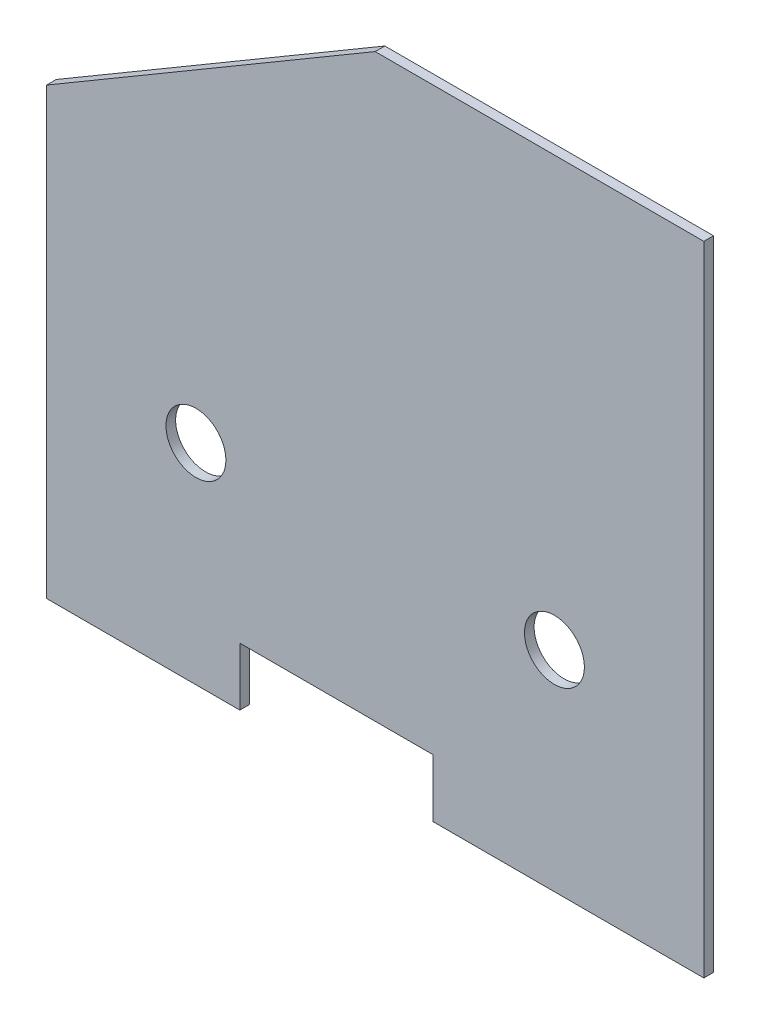
ISO-10303-21;
HEADER;
FILE_DESCRIPTION(('STEP AP214'),'2;1');
FILE_NAME('part.step','',(''),(''),'','','');
FILE_SCHEMA(('AUTOMOTIVE_DESIGN { 1 0 10303 214 1 1 1 1 }'));
ENDSEC;
DATA;
#1=APPLICATION_CONTEXT('core data for automotive mechanical design processes');
#2=APPLICATION_PROTOCOL_DEFINITION('international standard','automotive_design',2000,#1);
#3=PRODUCT_CONTEXT('',#1,'mechanical');
#4=PRODUCT('Part','Part','',(#3));
#5=PRODUCT_RELATED_PRODUCT_CATEGORY('part','',(#4));
#6=PRODUCT_DEFINITION_FORMATION('','',#4);
#7=PRODUCT_DEFINITION_CONTEXT('part definition',#1,'design');
#8=PRODUCT_DEFINITION('design','',#6,#7);
#9=PRODUCT_DEFINITION_SHAPE('','',#8);
#10=(LENGTH_UNIT() NAMED_UNIT(*) SI_UNIT(.MILLI.,.METRE.));
#11=(NAMED_UNIT(*) PLANE_ANGLE_UNIT() SI_UNIT($,.RADIAN.));
#12=(NAMED_UNIT(*) SI_UNIT($,.STERADIAN.) SOLID_ANGLE_UNIT());
#13=UNCERTAINTY_MEASURE_WITH_UNIT(LENGTH_MEASURE(1.E-05),#10,'distance_accuracy_value','');
#14=(GEOMETRIC_REPRESENTATION_CONTEXT(3) GLOBAL_UNCERTAINTY_ASSIGNED_CONTEXT((#13)) GLOBAL_UNIT_ASSIGNED_CONTEXT((#10,
#11,#12)) REPRESENTATION_CONTEXT('',''));
#15=CARTESIAN_POINT('',(0.,0.,0.));
#16=DIRECTION('',(0.,0.,1.));
#17=DIRECTION('',(1.,0.,0.));
#18=AXIS2_PLACEMENT_3D('',#15,#16,#17);
#19=CARTESIAN_POINT('',(431.8,12.7,6.35));
#20=DIRECTION('',(-1.,0.,0.));
#21=DIRECTION('',(0.,-1.,0.));
#22=AXIS2_PLACEMENT_3D('',#19,#20,#21);
#23=PLANE('',#22);
#24=DIRECTION('',(0.,1.,0.));
#25=VECTOR('',#24,1.);
#26=CARTESIAN_POINT('',(431.8,12.7,0.));
#27=LINE('',#26,#25);
#28=CARTESIAN_POINT('',(431.8,12.7,0.));
#29=VERTEX_POINT('',#28);
#30=CARTESIAN_POINT('',(431.8,431.8,0.));
#31=VERTEX_POINT('',#30);
#32=EDGE_CURVE('E137',#29,#31,#27,.T.);
#33=ORIENTED_EDGE('',*,*,#32,.T.);
#34=DIRECTION('',(0.,0.,-1.));
#35=VECTOR('',#34,1.);
#36=CARTESIAN_POINT('',(431.8,431.8,6.35));
#37=LINE('',#36,#35);
#38=CARTESIAN_POINT('',(431.8,431.8,6.35));
#39=VERTEX_POINT('',#38);
#40=EDGE_CURVE('E11',#39,#31,#37,.T.);
#41=ORIENTED_EDGE('',*,*,#40,.F.);
#42=DIRECTION('',(0.,1.,0.));
#43=VECTOR('',#42,1.);
#44=CARTESIAN_POINT('',(431.8,12.7,6.35));
#45=LINE('',#44,#43);
#46=CARTESIAN_POINT('',(431.8,12.7,6.35));
#47=VERTEX_POINT('',#46);
#48=EDGE_CURVE('E154',#47,#39,#45,.T.);
#49=ORIENTED_EDGE('',*,*,#48,.F.);
#50=DIRECTION('',(0.,0.,-1.));
#51=VECTOR('',#50,1.);
#52=CARTESIAN_POINT('',(431.8,12.7,6.35));
#53=LINE('',#52,#51);
#54=EDGE_CURVE('E133',#47,#29,#53,.T.);
#55=ORIENTED_EDGE('',*,*,#54,.T.);
#56=EDGE_LOOP('',(#33,#41,#49,#55));
#57=FACE_BOUND('',#56,.T.);
#58=ADVANCED_FACE('F35',(#57),#23,.F.);
#59=CARTESIAN_POINT('',(215.9,431.8,6.35));
#60=DIRECTION('',(0.,-1.,0.));
#61=DIRECTION('',(0.,0.,-1.));
#62=AXIS2_PLACEMENT_3D('',#59,#60,#61);
#63=PLANE('',#62);
#64=DIRECTION('',(-1.,0.,0.));
#65=VECTOR('',#64,1.);
#66=CARTESIAN_POINT('',(215.9,431.8,0.));
#67=LINE('',#66,#65);
#68=CARTESIAN_POINT('',(215.9,431.8,0.));
#69=VERTEX_POINT('',#68);
#70=EDGE_CURVE('E140',#31,#69,#67,.T.);
#71=ORIENTED_EDGE('',*,*,#70,.T.);
#72=DIRECTION('',(0.,0.,-1.));
#73=VECTOR('',#72,1.);
#74=CARTESIAN_POINT('',(215.9,431.8,6.35));
#75=LINE('',#74,#73);
#76=CARTESIAN_POINT('',(215.9,431.8,6.35));
#77=VERTEX_POINT('',#76);
#78=EDGE_CURVE('E43',#77,#69,#75,.T.);
#79=ORIENTED_EDGE('',*,*,#78,.F.);
#80=DIRECTION('',(-1.,0.,0.));
#81=VECTOR('',#80,1.);
#82=CARTESIAN_POINT('',(215.9,431.8,6.35));
#83=LINE('',#82,#81);
#84=EDGE_CURVE('E97',#39,#77,#83,.T.);
#85=ORIENTED_EDGE('',*,*,#84,.F.);
#86=ORIENTED_EDGE('',*,*,#40,.T.);
#87=EDGE_LOOP('',(#71,#79,#85,#86));
#88=FACE_BOUND('',#87,.T.);
#89=ADVANCED_FACE('F231',(#88),#63,.F.);
#90=CARTESIAN_POINT('',(0.,304.8,6.35));
#91=DIRECTION('',(0.507020126563394,-0.861934215157769,0.));
#92=DIRECTION('',(0.86193421515777,0.507020126563394,0.));
#93=AXIS2_PLACEMENT_3D('',#90,#91,#92);
#94=PLANE('',#93);
#95=DIRECTION('',(-0.861934215157769,-0.507020126563394,0.));
#96=VECTOR('',#95,1.);
#97=CARTESIAN_POINT('',(0.,304.8,0.));
#98=LINE('',#97,#96);
#99=CARTESIAN_POINT('',(0.,304.8,0.));
#100=VERTEX_POINT('',#99);
#101=EDGE_CURVE('E143',#69,#100,#98,.T.);
#102=ORIENTED_EDGE('',*,*,#101,.T.);
#103=DIRECTION('',(0.,0.,-1.));
#104=VECTOR('',#103,1.);
#105=CARTESIAN_POINT('',(0.,304.8,6.35));
#106=LINE('',#105,#104);
#107=CARTESIAN_POINT('',(0.,304.8,6.35));
#108=VERTEX_POINT('',#107);
#109=EDGE_CURVE('E164',#108,#100,#106,.T.);
#110=ORIENTED_EDGE('',*,*,#109,.F.);
#111=DIRECTION('',(-0.861934215157769,-0.507020126563394,0.));
#112=VECTOR('',#111,1.);
#113=CARTESIAN_POINT('',(0.,304.8,6.35));
#114=LINE('',#113,#112);
#115=EDGE_CURVE('E172',#77,#108,#114,.T.);
#116=ORIENTED_EDGE('',*,*,#115,.F.);
#117=ORIENTED_EDGE('',*,*,#78,.T.);
#118=EDGE_LOOP('',(#102,#110,#116,#117));
#119=FACE_BOUND('',#118,.T.);
#120=ADVANCED_FACE('F170',(#119),#94,.F.);
#121=CARTESIAN_POINT('',(0.,304.8,6.35));
#122=DIRECTION('',(1.,0.,0.));
#123=DIRECTION('',(0.,1.,0.));
#124=AXIS2_PLACEMENT_3D('',#121,#122,#123);
#125=PLANE('',#124);
#126=DIRECTION('',(0.,-1.,0.));
#127=VECTOR('',#126,1.);
#128=CARTESIAN_POINT('',(0.,304.8,0.));
#129=LINE('',#128,#127);
#130=CARTESIAN_POINT('',(0.,12.7,0.));
#131=VERTEX_POINT('',#130);
#132=EDGE_CURVE('E145',#100,#131,#129,.T.);
#133=ORIENTED_EDGE('',*,*,#132,.T.);
#134=DIRECTION('',(0.,0.,-1.));
#135=VECTOR('',#134,1.);
#136=CARTESIAN_POINT('',(0.,12.7,6.35));
#137=LINE('',#136,#135);
#138=CARTESIAN_POINT('',(0.,12.7,6.35));
#139=VERTEX_POINT('',#138);
#140=EDGE_CURVE('E161',#139,#131,#137,.T.);
#141=ORIENTED_EDGE('',*,*,#140,.F.);
#142=DIRECTION('',(0.,-1.,0.));
#143=VECTOR('',#142,1.);
#144=CARTESIAN_POINT('',(0.,304.8,6.35));
#145=LINE('',#144,#143);
#146=EDGE_CURVE('E188',#108,#139,#145,.T.);
#147=ORIENTED_EDGE('',*,*,#146,.F.);
#148=ORIENTED_EDGE('',*,*,#109,.T.);
#149=EDGE_LOOP('',(#133,#141,#147,#148));
#150=FACE_BOUND('',#149,.T.);
#151=ADVANCED_FACE('F181',(#150),#125,.F.);
#152=CARTESIAN_POINT('',(0.,12.7,6.35));
#153=DIRECTION('',(0.,1.,0.));
#154=DIRECTION('',(-1.,0.,0.));
#155=AXIS2_PLACEMENT_3D('',#152,#153,#154);
#156=PLANE('',#155);
#157=DIRECTION('',(1.,0.,0.));
#158=VECTOR('',#157,1.);
#159=CARTESIAN_POINT('',(0.,12.7,0.));
#160=LINE('',#159,#158);
#161=CARTESIAN_POINT('',(127.,12.7,0.));
#162=VERTEX_POINT('',#161);
#163=EDGE_CURVE('E147',#131,#162,#160,.T.);
#164=ORIENTED_EDGE('',*,*,#163,.T.);
#165=DIRECTION('',(0.,0.,-1.));
#166=VECTOR('',#165,1.);
#167=CARTESIAN_POINT('',(127.,12.7,6.35));
#168=LINE('',#167,#166);
#169=CARTESIAN_POINT('',(127.,12.7,6.35));
#170=VERTEX_POINT('',#169);
#171=EDGE_CURVE('E158',#170,#162,#168,.T.);
#172=ORIENTED_EDGE('',*,*,#171,.F.);
#173=DIRECTION('',(1.,0.,0.));
#174=VECTOR('',#173,1.);
#175=CARTESIAN_POINT('',(0.,12.7,6.35));
#176=LINE('',#175,#174);
#177=EDGE_CURVE('E187',#139,#170,#176,.T.);
#178=ORIENTED_EDGE('',*,*,#177,.F.);
#179=ORIENTED_EDGE('',*,*,#140,.T.);
#180=EDGE_LOOP('',(#164,#172,#178,#179));
#181=FACE_BOUND('',#180,.T.);
#182=ADVANCED_FACE('F185',(#181),#156,.F.);
#183=CARTESIAN_POINT('',(127.,12.7,6.35));
#184=DIRECTION('',(-1.,0.,0.));
#185=DIRECTION('',(0.,0.,1.));
#186=AXIS2_PLACEMENT_3D('',#183,#184,#185);
#187=PLANE('',#186);
#188=DIRECTION('',(0.,1.,0.));
#189=VECTOR('',#188,1.);
#190=CARTESIAN_POINT('',(127.,12.7,0.));
#191=LINE('',#190,#189);
#192=CARTESIAN_POINT('',(127.,50.8,0.));
#193=VERTEX_POINT('',#192);
#194=EDGE_CURVE('E149',#162,#193,#191,.T.);
#195=ORIENTED_EDGE('',*,*,#194,.T.);
#196=DIRECTION('',(0.,0.,-1.));
#197=VECTOR('',#196,1.);
#198=CARTESIAN_POINT('',(127.,50.8,6.35));
#199=LINE('',#198,#197);
#200=CARTESIAN_POINT('',(127.,50.8,6.35));
#201=VERTEX_POINT('',#200);
#202=EDGE_CURVE('E128',#201,#193,#199,.T.);
#203=ORIENTED_EDGE('',*,*,#202,.F.);
#204=DIRECTION('',(0.,1.,0.));
#205=VECTOR('',#204,1.);
#206=CARTESIAN_POINT('',(127.,12.7,6.35));
#207=LINE('',#206,#205);
#208=EDGE_CURVE('E119',#170,#201,#207,.T.);
#209=ORIENTED_EDGE('',*,*,#208,.F.);
#210=ORIENTED_EDGE('',*,*,#171,.T.);
#211=EDGE_LOOP('',(#195,#203,#209,#210));
#212=FACE_BOUND('',#211,.T.);
#213=ADVANCED_FACE('F239',(#212),#187,.F.);
#214=CARTESIAN_POINT('',(254.,50.8,6.35));
#215=DIRECTION('',(0.,1.,0.));
#216=DIRECTION('',(-1.,0.,0.));
#217=AXIS2_PLACEMENT_3D('',#214,#215,#216);
#218=PLANE('',#217);
#219=DIRECTION('',(1.,0.,0.));
#220=VECTOR('',#219,1.);
#221=CARTESIAN_POINT('',(254.,50.8,0.));
#222=LINE('',#221,#220);
#223=CARTESIAN_POINT('',(254.,50.8,0.));
#224=VERTEX_POINT('',#223);
#225=EDGE_CURVE('E127',#193,#224,#222,.T.);
#226=ORIENTED_EDGE('',*,*,#225,.T.);
#227=DIRECTION('',(0.,0.,-1.));
#228=VECTOR('',#227,1.);
#229=CARTESIAN_POINT('',(254.,50.8,6.35));
#230=LINE('',#229,#228);
#231=CARTESIAN_POINT('',(254.,50.8,6.35));
#232=VERTEX_POINT('',#231);
#233=EDGE_CURVE('E124',#232,#224,#230,.T.);
#234=ORIENTED_EDGE('',*,*,#233,.F.);
#235=DIRECTION('',(1.,0.,0.));
#236=VECTOR('',#235,1.);
#237=CARTESIAN_POINT('',(254.,50.8,6.35));
#238=LINE('',#237,#236);
#239=EDGE_CURVE('E113',#201,#232,#238,.T.);
#240=ORIENTED_EDGE('',*,*,#239,.F.);
#241=ORIENTED_EDGE('',*,*,#202,.T.);
#242=EDGE_LOOP('',(#226,#234,#240,#241));
#243=FACE_BOUND('',#242,.T.);
#244=ADVANCED_FACE('F125',(#243),#218,.F.);
#245=CARTESIAN_POINT('',(254.,50.8,6.35));
#246=DIRECTION('',(1.,0.,0.));
#247=DIRECTION('',(0.,1.,0.));
#248=AXIS2_PLACEMENT_3D('',#245,#246,#247);
#249=PLANE('',#248);
#250=DIRECTION('',(0.,-1.,0.));
#251=VECTOR('',#250,1.);
#252=CARTESIAN_POINT('',(254.,50.8,0.));
#253=LINE('',#252,#251);
#254=CARTESIAN_POINT('',(254.,12.7,0.));
#255=VERTEX_POINT('',#254);
#256=EDGE_CURVE('E83',#224,#255,#253,.T.);
#257=ORIENTED_EDGE('',*,*,#256,.T.);
#258=DIRECTION('',(0.,0.,-1.));
#259=VECTOR('',#258,1.);
#260=CARTESIAN_POINT('',(254.,12.7,6.35));
#261=LINE('',#260,#259);
#262=CARTESIAN_POINT('',(254.,12.7,6.35));
#263=VERTEX_POINT('',#262);
#264=EDGE_CURVE('E129',#263,#255,#261,.T.);
#265=ORIENTED_EDGE('',*,*,#264,.F.);
#266=DIRECTION('',(0.,-1.,0.));
#267=VECTOR('',#266,1.);
#268=CARTESIAN_POINT('',(254.,50.8,6.35));
#269=LINE('',#268,#267);
#270=EDGE_CURVE('E117',#232,#263,#269,.T.);
#271=ORIENTED_EDGE('',*,*,#270,.F.);
#272=ORIENTED_EDGE('',*,*,#233,.T.);
#273=EDGE_LOOP('',(#257,#265,#271,#272));
#274=FACE_BOUND('',#273,.T.);
#275=ADVANCED_FACE('F131',(#274),#249,.F.);
#276=CARTESIAN_POINT('',(254.,12.7,6.35));
#277=DIRECTION('',(0.,1.,0.));
#278=DIRECTION('',(-1.,0.,0.));
#279=AXIS2_PLACEMENT_3D('',#276,#277,#278);
#280=PLANE('',#279);
#281=DIRECTION('',(1.,0.,0.));
#282=VECTOR('',#281,1.);
#283=CARTESIAN_POINT('',(254.,12.7,0.));
#284=LINE('',#283,#282);
#285=EDGE_CURVE('E89',#255,#29,#284,.T.);
#286=ORIENTED_EDGE('',*,*,#285,.T.);
#287=ORIENTED_EDGE('',*,*,#54,.F.);
#288=DIRECTION('',(1.,0.,0.));
#289=VECTOR('',#288,1.);
#290=CARTESIAN_POINT('',(254.,12.7,6.35));
#291=LINE('',#290,#289);
#292=EDGE_CURVE('E51',#263,#47,#291,.T.);
#293=ORIENTED_EDGE('',*,*,#292,.F.);
#294=ORIENTED_EDGE('',*,*,#264,.T.);
#295=EDGE_LOOP('',(#286,#287,#293,#294));
#296=FACE_BOUND('',#295,.T.);
#297=ADVANCED_FACE('F218',(#296),#280,.F.);
#298=CARTESIAN_POINT('',(0.,0.,6.35));
#299=DIRECTION('',(0.,0.,-1.));
#300=DIRECTION('',(-1.,0.,0.));
#301=AXIS2_PLACEMENT_3D('',#298,#299,#300);
#302=PLANE('',#301);
#303=CARTESIAN_POINT('',(333.65,150.3,6.35));
#304=DIRECTION('',(0.,0.,1.));
#305=DIRECTION('',(1.,0.,0.));
#306=AXIS2_PLACEMENT_3D('',#303,#304,#305);
#307=CIRCLE('',#306,19.685);
#308=CARTESIAN_POINT('',(353.335,150.3,6.35));
#309=VERTEX_POINT('',#308);
#310=EDGE_CURVE('E201',#309,#309,#307,.T.);
#311=ORIENTED_EDGE('',*,*,#310,.F.);
#312=EDGE_LOOP('',(#311));
#313=FACE_BOUND('',#312,.T.);
#314=CARTESIAN_POINT('',(98.15,150.3,6.35));
#315=DIRECTION('',(0.,0.,1.));
#316=DIRECTION('',(1.,0.,0.));
#317=AXIS2_PLACEMENT_3D('',#314,#315,#316);
#318=CIRCLE('',#317,19.685);
#319=CARTESIAN_POINT('',(117.835,150.3,6.35));
#320=VERTEX_POINT('',#319);
#321=EDGE_CURVE('E195',#320,#320,#318,.T.);
#322=ORIENTED_EDGE('',*,*,#321,.F.);
#323=EDGE_LOOP('',(#322));
#324=FACE_BOUND('',#323,.T.);
#325=ORIENTED_EDGE('',*,*,#48,.T.);
#326=ORIENTED_EDGE('',*,*,#84,.T.);
#327=ORIENTED_EDGE('',*,*,#115,.T.);
#328=ORIENTED_EDGE('',*,*,#146,.T.);
#329=ORIENTED_EDGE('',*,*,#177,.T.);
#330=ORIENTED_EDGE('',*,*,#208,.T.);
#331=ORIENTED_EDGE('',*,*,#239,.T.);
#332=ORIENTED_EDGE('',*,*,#270,.T.);
#333=ORIENTED_EDGE('',*,*,#292,.T.);
#334=EDGE_LOOP('',(#325,#326,#327,#328,#329,#330,#331,#332,#333));
#335=FACE_BOUND('',#334,.T.);
#336=ADVANCED_FACE('F115',(#313,#324,#335),#302,.F.);
#337=CARTESIAN_POINT('',(0.,0.,0.));
#338=DIRECTION('',(0.,0.,-1.));
#339=DIRECTION('',(-1.,0.,0.));
#340=AXIS2_PLACEMENT_3D('',#337,#338,#339);
#341=PLANE('',#340);
#342=CARTESIAN_POINT('',(333.65,150.3,0.));
#343=DIRECTION('',(0.,0.,1.));
#344=DIRECTION('',(1.,0.,0.));
#345=AXIS2_PLACEMENT_3D('',#342,#343,#344);
#346=CIRCLE('',#345,19.685);
#347=CARTESIAN_POINT('',(353.335,150.3,0.));
#348=VERTEX_POINT('',#347);
#349=EDGE_CURVE('E198',#348,#348,#346,.T.);
#350=ORIENTED_EDGE('',*,*,#349,.T.);
#351=EDGE_LOOP('',(#350));
#352=FACE_BOUND('',#351,.T.);
#353=CARTESIAN_POINT('',(98.15,150.3,0.));
#354=DIRECTION('',(0.,0.,1.));
#355=DIRECTION('',(1.,0.,0.));
#356=AXIS2_PLACEMENT_3D('',#353,#354,#355);
#357=CIRCLE('',#356,19.685);
#358=CARTESIAN_POINT('',(117.835,150.3,0.));
#359=VERTEX_POINT('',#358);
#360=EDGE_CURVE('E141',#359,#359,#357,.T.);
#361=ORIENTED_EDGE('',*,*,#360,.T.);
#362=EDGE_LOOP('',(#361));
#363=FACE_BOUND('',#362,.T.);
#364=ORIENTED_EDGE('',*,*,#32,.F.);
#365=ORIENTED_EDGE('',*,*,#285,.F.);
#366=ORIENTED_EDGE('',*,*,#256,.F.);
#367=ORIENTED_EDGE('',*,*,#225,.F.);
#368=ORIENTED_EDGE('',*,*,#194,.F.);
#369=ORIENTED_EDGE('',*,*,#163,.F.);
#370=ORIENTED_EDGE('',*,*,#132,.F.);
#371=ORIENTED_EDGE('',*,*,#101,.F.);
#372=ORIENTED_EDGE('',*,*,#70,.F.);
#373=EDGE_LOOP('',(#364,#365,#366,#367,#368,#369,#370,#371,#372));
#374=FACE_BOUND('',#373,.T.);
#375=ADVANCED_FACE('F176',(#352,#363,#374),#341,.T.);
#376=CARTESIAN_POINT('',(98.15,150.3,0.));
#377=DIRECTION('',(0.,0.,1.));
#378=DIRECTION('',(1.,0.,0.));
#379=AXIS2_PLACEMENT_3D('',#376,#377,#378);
#380=CYLINDRICAL_SURFACE('',#379,19.685);
#381=ORIENTED_EDGE('',*,*,#360,.F.);
#382=EDGE_LOOP('',(#381));
#383=FACE_BOUND('',#382,.T.);
#384=ORIENTED_EDGE('',*,*,#321,.T.);
#385=EDGE_LOOP('',(#384));
#386=FACE_BOUND('',#385,.T.);
#387=ADVANCED_FACE('F212',(#383,#386),#380,.F.);
#388=CARTESIAN_POINT('',(333.65,150.3,0.));
#389=DIRECTION('',(0.,0.,1.));
#390=DIRECTION('',(1.,0.,0.));
#391=AXIS2_PLACEMENT_3D('',#388,#389,#390);
#392=CYLINDRICAL_SURFACE('',#391,19.685);
#393=ORIENTED_EDGE('',*,*,#349,.F.);
#394=EDGE_LOOP('',(#393));
#395=FACE_BOUND('',#394,.T.);
#396=ORIENTED_EDGE('',*,*,#310,.T.);
#397=EDGE_LOOP('',(#396));
#398=FACE_BOUND('',#397,.T.);
#399=ADVANCED_FACE('F209',(#395,#398),#392,.F.);
#400=CLOSED_SHELL('',(#58,#89,#120,#151,#182,#213,#244,#275,#297,#336,#375,#387,#399));
#401=MANIFOLD_SOLID_BREP('B2',#400);
#402=ADVANCED_BREP_SHAPE_REPRESENTATION('',(#18,#401),#14);
#403=SHAPE_DEFINITION_REPRESENTATION(#9,#402);
ENDSEC;
END-ISO-10303-21;
